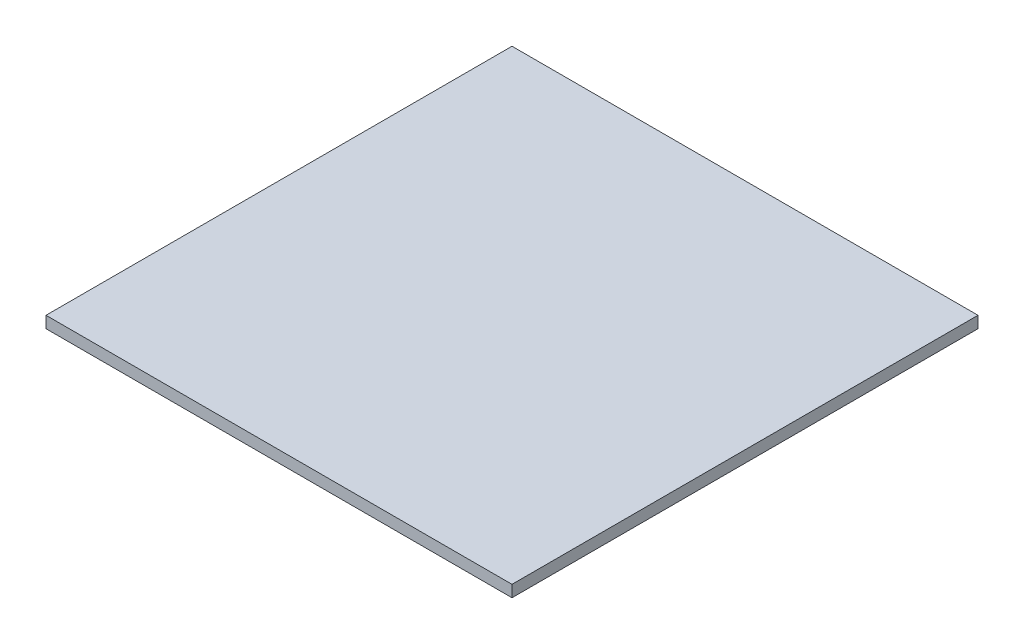
ISO-10303-21;
HEADER;
FILE_DESCRIPTION(('STEP AP214'),'2;1');
FILE_NAME('part.step','',(''),(''),'','','');
FILE_SCHEMA(('AUTOMOTIVE_DESIGN { 1 0 10303 214 1 1 1 1 }'));
ENDSEC;
DATA;
#1=APPLICATION_CONTEXT('core data for automotive mechanical design processes');
#2=APPLICATION_PROTOCOL_DEFINITION('international standard','automotive_design',2000,#1);
#3=PRODUCT_CONTEXT('',#1,'mechanical');
#4=PRODUCT('Part','Part','',(#3));
#5=PRODUCT_RELATED_PRODUCT_CATEGORY('part','',(#4));
#6=PRODUCT_DEFINITION_FORMATION('','',#4);
#7=PRODUCT_DEFINITION_CONTEXT('part definition',#1,'design');
#8=PRODUCT_DEFINITION('design','',#6,#7);
#9=PRODUCT_DEFINITION_SHAPE('','',#8);
#10=(LENGTH_UNIT() NAMED_UNIT(*) SI_UNIT(.MILLI.,.METRE.));
#11=(NAMED_UNIT(*) PLANE_ANGLE_UNIT() SI_UNIT($,.RADIAN.));
#12=(NAMED_UNIT(*) SI_UNIT($,.STERADIAN.) SOLID_ANGLE_UNIT());
#13=UNCERTAINTY_MEASURE_WITH_UNIT(LENGTH_MEASURE(1.E-05),#10,'distance_accuracy_value','');
#14=(GEOMETRIC_REPRESENTATION_CONTEXT(3) GLOBAL_UNCERTAINTY_ASSIGNED_CONTEXT((#13)) GLOBAL_UNIT_ASSIGNED_CONTEXT((#10,
#11,#12)) REPRESENTATION_CONTEXT('',''));
#15=CARTESIAN_POINT('',(0.,0.,0.));
#16=DIRECTION('',(0.,0.,1.));
#17=DIRECTION('',(1.,0.,0.));
#18=AXIS2_PLACEMENT_3D('',#15,#16,#17);
#19=CARTESIAN_POINT('',(25.,1.25,25.));
#20=DIRECTION('',(-1.,0.,0.));
#21=DIRECTION('',(0.,0.,1.));
#22=AXIS2_PLACEMENT_3D('',#19,#20,#21);
#23=PLANE('',#22);
#24=DIRECTION('',(0.,0.,-1.));
#25=VECTOR('',#24,1.);
#26=CARTESIAN_POINT('',(25.,0.,25.));
#27=LINE('',#26,#25);
#28=CARTESIAN_POINT('',(25.,0.,25.));
#29=VERTEX_POINT('',#28);
#30=CARTESIAN_POINT('',(25.,0.,-25.));
#31=VERTEX_POINT('',#30);
#32=EDGE_CURVE('E98',#29,#31,#27,.T.);
#33=ORIENTED_EDGE('',*,*,#32,.T.);
#34=DIRECTION('',(0.,-1.,0.));
#35=VECTOR('',#34,1.);
#36=CARTESIAN_POINT('',(25.,1.25,-25.));
#37=LINE('',#36,#35);
#38=CARTESIAN_POINT('',(25.,1.25,-25.));
#39=VERTEX_POINT('',#38);
#40=EDGE_CURVE('E11',#39,#31,#37,.T.);
#41=ORIENTED_EDGE('',*,*,#40,.F.);
#42=DIRECTION('',(0.,0.,-1.));
#43=VECTOR('',#42,1.);
#44=CARTESIAN_POINT('',(25.,1.25,25.));
#45=LINE('',#44,#43);
#46=CARTESIAN_POINT('',(25.,1.25,25.));
#47=VERTEX_POINT('',#46);
#48=EDGE_CURVE('E86',#47,#39,#45,.T.);
#49=ORIENTED_EDGE('',*,*,#48,.F.);
#50=DIRECTION('',(0.,-1.,0.));
#51=VECTOR('',#50,1.);
#52=CARTESIAN_POINT('',(25.,1.25,25.));
#53=LINE('',#52,#51);
#54=EDGE_CURVE('E94',#47,#29,#53,.T.);
#55=ORIENTED_EDGE('',*,*,#54,.T.);
#56=EDGE_LOOP('',(#33,#41,#49,#55));
#57=FACE_BOUND('',#56,.T.);
#58=ADVANCED_FACE('F35',(#57),#23,.F.);
#59=CARTESIAN_POINT('',(-25.,1.25,-25.));
#60=DIRECTION('',(0.,0.,1.));
#61=DIRECTION('',(1.,0.,0.));
#62=AXIS2_PLACEMENT_3D('',#59,#60,#61);
#63=PLANE('',#62);
#64=DIRECTION('',(-1.,0.,0.));
#65=VECTOR('',#64,1.);
#66=CARTESIAN_POINT('',(-25.,0.,-25.));
#67=LINE('',#66,#65);
#68=CARTESIAN_POINT('',(-25.,0.,-25.));
#69=VERTEX_POINT('',#68);
#70=EDGE_CURVE('E90',#31,#69,#67,.T.);
#71=ORIENTED_EDGE('',*,*,#70,.T.);
#72=DIRECTION('',(0.,-1.,0.));
#73=VECTOR('',#72,1.);
#74=CARTESIAN_POINT('',(-25.,1.25,-25.));
#75=LINE('',#74,#73);
#76=CARTESIAN_POINT('',(-25.,1.25,-25.));
#77=VERTEX_POINT('',#76);
#78=EDGE_CURVE('E43',#77,#69,#75,.T.);
#79=ORIENTED_EDGE('',*,*,#78,.F.);
#80=DIRECTION('',(-1.,0.,0.));
#81=VECTOR('',#80,1.);
#82=CARTESIAN_POINT('',(-25.,1.25,-25.));
#83=LINE('',#82,#81);
#84=EDGE_CURVE('E81',#39,#77,#83,.T.);
#85=ORIENTED_EDGE('',*,*,#84,.F.);
#86=ORIENTED_EDGE('',*,*,#40,.T.);
#87=EDGE_LOOP('',(#71,#79,#85,#86));
#88=FACE_BOUND('',#87,.T.);
#89=ADVANCED_FACE('F89',(#88),#63,.F.);
#90=CARTESIAN_POINT('',(-25.,1.25,25.));
#91=DIRECTION('',(1.,0.,0.));
#92=DIRECTION('',(0.,0.,-1.));
#93=AXIS2_PLACEMENT_3D('',#90,#91,#92);
#94=PLANE('',#93);
#95=DIRECTION('',(0.,0.,1.));
#96=VECTOR('',#95,1.);
#97=CARTESIAN_POINT('',(-25.,0.,25.));
#98=LINE('',#97,#96);
#99=CARTESIAN_POINT('',(-25.,0.,25.));
#100=VERTEX_POINT('',#99);
#101=EDGE_CURVE('E68',#69,#100,#98,.T.);
#102=ORIENTED_EDGE('',*,*,#101,.T.);
#103=DIRECTION('',(0.,-1.,0.));
#104=VECTOR('',#103,1.);
#105=CARTESIAN_POINT('',(-25.,1.25,25.));
#106=LINE('',#105,#104);
#107=CARTESIAN_POINT('',(-25.,1.25,25.));
#108=VERTEX_POINT('',#107);
#109=EDGE_CURVE('E91',#108,#100,#106,.T.);
#110=ORIENTED_EDGE('',*,*,#109,.F.);
#111=DIRECTION('',(0.,0.,1.));
#112=VECTOR('',#111,1.);
#113=CARTESIAN_POINT('',(-25.,1.25,25.));
#114=LINE('',#113,#112);
#115=EDGE_CURVE('E84',#77,#108,#114,.T.);
#116=ORIENTED_EDGE('',*,*,#115,.F.);
#117=ORIENTED_EDGE('',*,*,#78,.T.);
#118=EDGE_LOOP('',(#102,#110,#116,#117));
#119=FACE_BOUND('',#118,.T.);
#120=ADVANCED_FACE('F92',(#119),#94,.F.);
#121=CARTESIAN_POINT('',(-25.,1.25,25.));
#122=DIRECTION('',(0.,0.,-1.));
#123=DIRECTION('',(-1.,0.,0.));
#124=AXIS2_PLACEMENT_3D('',#121,#122,#123);
#125=PLANE('',#124);
#126=DIRECTION('',(1.,0.,0.));
#127=VECTOR('',#126,1.);
#128=CARTESIAN_POINT('',(-25.,0.,25.));
#129=LINE('',#128,#127);
#130=EDGE_CURVE('E74',#100,#29,#129,.T.);
#131=ORIENTED_EDGE('',*,*,#130,.T.);
#132=ORIENTED_EDGE('',*,*,#54,.F.);
#133=DIRECTION('',(1.,0.,0.));
#134=VECTOR('',#133,1.);
#135=CARTESIAN_POINT('',(-25.,1.25,25.));
#136=LINE('',#135,#134);
#137=EDGE_CURVE('E51',#108,#47,#136,.T.);
#138=ORIENTED_EDGE('',*,*,#137,.F.);
#139=ORIENTED_EDGE('',*,*,#109,.T.);
#140=EDGE_LOOP('',(#131,#132,#138,#139));
#141=FACE_BOUND('',#140,.T.);
#142=ADVANCED_FACE('F105',(#141),#125,.F.);
#143=CARTESIAN_POINT('',(0.,1.25,0.));
#144=DIRECTION('',(0.,-1.,0.));
#145=DIRECTION('',(0.,0.,-1.));
#146=AXIS2_PLACEMENT_3D('',#143,#144,#145);
#147=PLANE('',#146);
#148=ORIENTED_EDGE('',*,*,#48,.T.);
#149=ORIENTED_EDGE('',*,*,#84,.T.);
#150=ORIENTED_EDGE('',*,*,#115,.T.);
#151=ORIENTED_EDGE('',*,*,#137,.T.);
#152=EDGE_LOOP('',(#148,#149,#150,#151));
#153=FACE_BOUND('',#152,.T.);
#154=ADVANCED_FACE('F82',(#153),#147,.F.);
#155=CARTESIAN_POINT('',(0.,0.,0.));
#156=DIRECTION('',(0.,-1.,0.));
#157=DIRECTION('',(0.,0.,-1.));
#158=AXIS2_PLACEMENT_3D('',#155,#156,#157);
#159=PLANE('',#158);
#160=ORIENTED_EDGE('',*,*,#32,.F.);
#161=ORIENTED_EDGE('',*,*,#130,.F.);
#162=ORIENTED_EDGE('',*,*,#101,.F.);
#163=ORIENTED_EDGE('',*,*,#70,.F.);
#164=EDGE_LOOP('',(#160,#161,#162,#163));
#165=FACE_BOUND('',#164,.T.);
#166=ADVANCED_FACE('F108',(#165),#159,.T.);
#167=CLOSED_SHELL('',(#58,#89,#120,#142,#154,#166));
#168=MANIFOLD_SOLID_BREP('B2',#167);
#169=ADVANCED_BREP_SHAPE_REPRESENTATION('',(#18,#168),#14);
#170=SHAPE_DEFINITION_REPRESENTATION(#9,#169);
ENDSEC;
END-ISO-10303-21;
